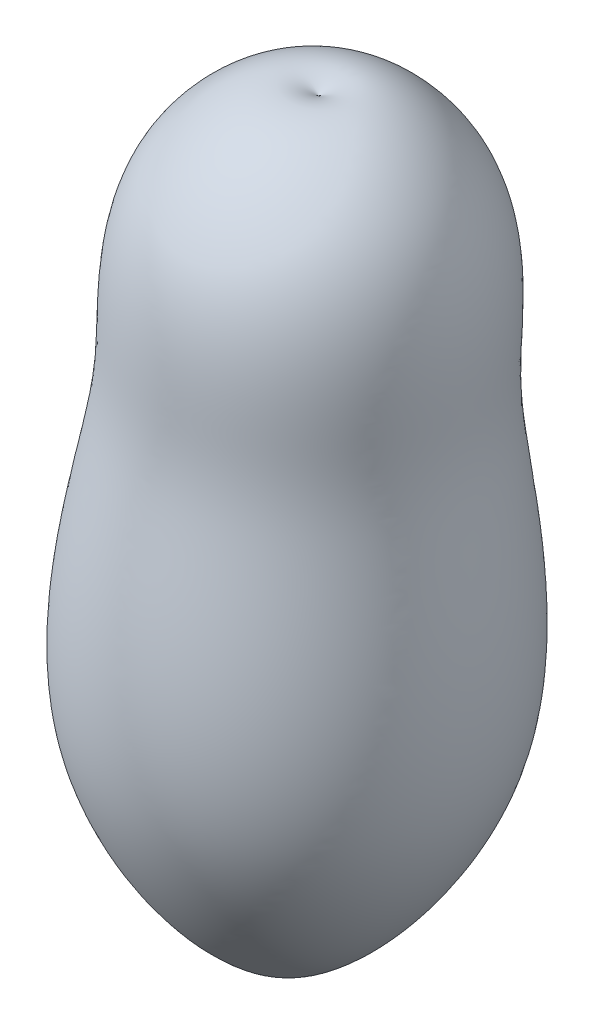
ISO-10303-21;
HEADER;
FILE_DESCRIPTION(('STEP AP214'),'2;1');
FILE_NAME('part.step','',(''),(''),'','','');
FILE_SCHEMA(('AUTOMOTIVE_DESIGN { 1 0 10303 214 1 1 1 1 }'));
ENDSEC;
DATA;
#1=APPLICATION_CONTEXT('core data for automotive mechanical design processes');
#2=APPLICATION_PROTOCOL_DEFINITION('international standard','automotive_design',2000,#1);
#3=PRODUCT_CONTEXT('',#1,'mechanical');
#4=PRODUCT('Part','Part','',(#3));
#5=PRODUCT_RELATED_PRODUCT_CATEGORY('part','',(#4));
#6=PRODUCT_DEFINITION_FORMATION('','',#4);
#7=PRODUCT_DEFINITION_CONTEXT('part definition',#1,'design');
#8=PRODUCT_DEFINITION('design','',#6,#7);
#9=PRODUCT_DEFINITION_SHAPE('','',#8);
#10=(LENGTH_UNIT() NAMED_UNIT(*) SI_UNIT(.MILLI.,.METRE.));
#11=(NAMED_UNIT(*) PLANE_ANGLE_UNIT() SI_UNIT($,.RADIAN.));
#12=(NAMED_UNIT(*) SI_UNIT($,.STERADIAN.) SOLID_ANGLE_UNIT());
#13=UNCERTAINTY_MEASURE_WITH_UNIT(LENGTH_MEASURE(1.E-05),#10,'distance_accuracy_value','');
#14=(GEOMETRIC_REPRESENTATION_CONTEXT(3) GLOBAL_UNCERTAINTY_ASSIGNED_CONTEXT((#13)) GLOBAL_UNIT_ASSIGNED_CONTEXT((#10,
#11,#12)) REPRESENTATION_CONTEXT('',''));
#15=CARTESIAN_POINT('',(0.,0.,0.));
#16=DIRECTION('',(0.,0.,1.));
#17=DIRECTION('',(1.,0.,0.));
#18=AXIS2_PLACEMENT_3D('',#15,#16,#17);
#19=CARTESIAN_POINT('',(-2.3394637651843E-05,51.2474911193214,1.3084133428478));
#20=CARTESIAN_POINT('',(-2.3394637651843E-05,53.3807979752675,-2.63877966822028));
#21=CARTESIAN_POINT('',(-2.3394637651843E-05,46.4372123266797,-12.2583360295215));
#22=CARTESIAN_POINT('',(-2.3394637651843E-05,33.3945486142333,-12.7187292676877));
#23=CARTESIAN_POINT('',(-2.3394637651843E-05,24.6085620358696,-11.5293208088567));
#24=CARTESIAN_POINT('',(-2.3394637651843E-05,-2.59645950214476,-17.3175329423427));
#25=CARTESIAN_POINT('',(-2.3394637651843E-05,-19.8094975627858,-0.37056444874919));
#26=CARTESIAN_POINT('',(-2.3394637651843E-05,-19.685051666034,4.33534916920912));
#27=CARTESIAN_POINT('',(-2.3394637651843E-05,-19.2440665872839,4.66607647867971));
#28=B_SPLINE_CURVE_WITH_KNOTS('',3,(#19,#20,#21,#22,#23,#24,#25,#26,#27),.UNSPECIFIED.,.F.,.F.,
(4,1,1,1,1,1,4),(0.,0.162523271049563,0.324286141908779,0.462871189864134,0.700038704872731,
0.915549533613059,1.),.UNSPECIFIED.);
#29=CARTESIAN_POINT('',(-2.3394637651843E-05,16.0017122660188,2.98724491076375));
#30=DIRECTION('',(0.,-0.998867516718026,0.0475781887587627));
#31=AXIS1_PLACEMENT('',#29,#30);
#32=SURFACE_OF_REVOLUTION('',#28,#31);
#33=CARTESIAN_POINT('',(-2.3394637651843E-05,-19.2440665872839,4.66607647867971));
#34=VERTEX_POINT('',#33);
#35=VERTEX_LOOP('',#34);
#36=FACE_BOUND('',#35,.T.);
#37=CARTESIAN_POINT('',(-2.3394637651843E-05,51.2474911193214,1.3084133428478));
#38=VERTEX_POINT('',#37);
#39=VERTEX_LOOP('',#38);
#40=FACE_BOUND('',#39,.T.);
#41=ADVANCED_FACE('F46',(#36,#40),#32,.T.);
#42=CLOSED_SHELL('',(#41));
#43=MANIFOLD_SOLID_BREP('B2',#42);
#44=ADVANCED_BREP_SHAPE_REPRESENTATION('',(#18,#43),#14);
#45=SHAPE_DEFINITION_REPRESENTATION(#9,#44);
ENDSEC;
END-ISO-10303-21;
